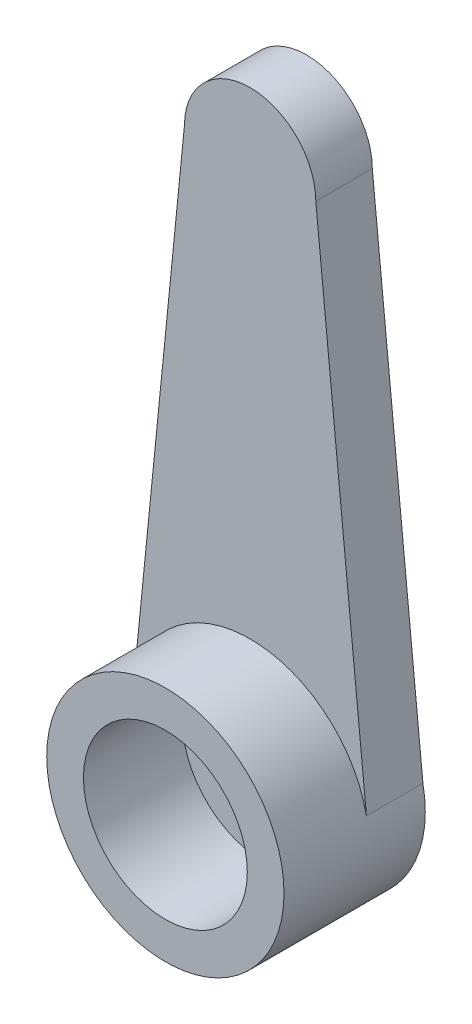
ISO-10303-21;
HEADER;
FILE_DESCRIPTION(('STEP AP214'),'2;1');
FILE_NAME('part.step','',(''),(''),'','','');
FILE_SCHEMA(('AUTOMOTIVE_DESIGN { 1 0 10303 214 1 1 1 1 }'));
ENDSEC;
DATA;
#1=APPLICATION_CONTEXT('core data for automotive mechanical design processes');
#2=APPLICATION_PROTOCOL_DEFINITION('international standard','automotive_design',2000,#1);
#3=PRODUCT_CONTEXT('',#1,'mechanical');
#4=PRODUCT('Part','Part','',(#3));
#5=PRODUCT_RELATED_PRODUCT_CATEGORY('part','',(#4));
#6=PRODUCT_DEFINITION_FORMATION('','',#4);
#7=PRODUCT_DEFINITION_CONTEXT('part definition',#1,'design');
#8=PRODUCT_DEFINITION('design','',#6,#7);
#9=PRODUCT_DEFINITION_SHAPE('','',#8);
#10=(LENGTH_UNIT() NAMED_UNIT(*) SI_UNIT(.MILLI.,.METRE.));
#11=(NAMED_UNIT(*) PLANE_ANGLE_UNIT() SI_UNIT($,.RADIAN.));
#12=(NAMED_UNIT(*) SI_UNIT($,.STERADIAN.) SOLID_ANGLE_UNIT());
#13=UNCERTAINTY_MEASURE_WITH_UNIT(LENGTH_MEASURE(1.E-05),#10,'distance_accuracy_value','');
#14=(GEOMETRIC_REPRESENTATION_CONTEXT(3) GLOBAL_UNCERTAINTY_ASSIGNED_CONTEXT((#13)) GLOBAL_UNIT_ASSIGNED_CONTEXT((#10,
#11,#12)) REPRESENTATION_CONTEXT('',''));
#15=CARTESIAN_POINT('',(0.,0.,0.));
#16=DIRECTION('',(0.,0.,1.));
#17=DIRECTION('',(1.,0.,0.));
#18=AXIS2_PLACEMENT_3D('',#15,#16,#17);
#19=CARTESIAN_POINT('',(4.15852541843245,0.41529881009645,2.));
#20=DIRECTION('',(0.995050300048582,0.0993725332937999,0.));
#21=DIRECTION('',(-0.0993725332937999,0.995050300048582,0.));
#22=AXIS2_PLACEMENT_3D('',#19,#20,#21);
#23=PLANE('',#22);
#24=DIRECTION('',(0.0993725332937999,-0.995050300048582,0.));
#25=VECTOR('',#24,1.);
#26=CARTESIAN_POINT('',(4.15852541843245,0.41529881009645,0.));
#27=LINE('',#26,#25);
#28=CARTESIAN_POINT('',(2.325,18.775,0.));
#29=VERTEX_POINT('',#28);
#30=CARTESIAN_POINT('',(4.11705083686489,0.830597620192895,0.));
#31=VERTEX_POINT('',#30);
#32=EDGE_CURVE('E80',#29,#31,#27,.T.);
#33=ORIENTED_EDGE('',*,*,#32,.F.);
#34=DIRECTION('',(0.,0.,-1.));
#35=VECTOR('',#34,1.);
#36=CARTESIAN_POINT('',(2.325,18.775,2.));
#37=LINE('',#36,#35);
#38=CARTESIAN_POINT('',(2.325,18.775,2.));
#39=VERTEX_POINT('',#38);
#40=EDGE_CURVE('E108',#39,#29,#37,.T.);
#41=ORIENTED_EDGE('',*,*,#40,.F.);
#42=DIRECTION('',(0.0993725332937999,-0.995050300048582,0.));
#43=VECTOR('',#42,1.);
#44=CARTESIAN_POINT('',(4.15852541843245,0.41529881009645,2.));
#45=LINE('',#44,#43);
#46=CARTESIAN_POINT('',(4.11705083686489,0.830597620192895,2.));
#47=VERTEX_POINT('',#46);
#48=EDGE_CURVE('E102',#39,#47,#45,.T.);
#49=ORIENTED_EDGE('',*,*,#48,.T.);
#50=DIRECTION('',(0.,0.,-1.));
#51=VECTOR('',#50,1.);
#52=CARTESIAN_POINT('',(4.11705083686489,0.830597620192895,2.));
#53=LINE('',#52,#51);
#54=EDGE_CURVE('E44',#47,#31,#53,.T.);
#55=ORIENTED_EDGE('',*,*,#54,.T.);
#56=EDGE_LOOP('',(#33,#41,#49,#55));
#57=FACE_BOUND('',#56,.T.);
#58=ADVANCED_FACE('F36',(#57),#23,.T.);
#59=CARTESIAN_POINT('',(0.,18.775,2.));
#60=DIRECTION('',(0.,0.,-1.));
#61=DIRECTION('',(-1.,0.,0.));
#62=AXIS2_PLACEMENT_3D('',#59,#60,#61);
#63=CYLINDRICAL_SURFACE('',#62,2.325);
#64=CARTESIAN_POINT('',(0.,18.775,0.));
#65=DIRECTION('',(0.,0.,1.));
#66=DIRECTION('',(1.,0.,0.));
#67=AXIS2_PLACEMENT_3D('',#64,#65,#66);
#68=CIRCLE('',#67,2.325);
#69=CARTESIAN_POINT('',(-2.325,18.775,0.));
#70=VERTEX_POINT('',#69);
#71=EDGE_CURVE('E65',#29,#70,#68,.T.);
#72=ORIENTED_EDGE('',*,*,#71,.T.);
#73=DIRECTION('',(0.,0.,-1.));
#74=VECTOR('',#73,1.);
#75=CARTESIAN_POINT('',(-2.325,18.775,2.));
#76=LINE('',#75,#74);
#77=CARTESIAN_POINT('',(-2.325,18.775,2.));
#78=VERTEX_POINT('',#77);
#79=EDGE_CURVE('E97',#78,#70,#76,.T.);
#80=ORIENTED_EDGE('',*,*,#79,.F.);
#81=CARTESIAN_POINT('',(0.,18.775,2.));
#82=DIRECTION('',(0.,0.,1.));
#83=DIRECTION('',(1.,0.,0.));
#84=AXIS2_PLACEMENT_3D('',#81,#82,#83);
#85=CIRCLE('',#84,2.325);
#86=EDGE_CURVE('E52',#39,#78,#85,.T.);
#87=ORIENTED_EDGE('',*,*,#86,.F.);
#88=ORIENTED_EDGE('',*,*,#40,.T.);
#89=EDGE_LOOP('',(#72,#80,#87,#88));
#90=FACE_BOUND('',#89,.T.);
#91=ADVANCED_FACE('F144',(#90),#63,.T.);
#92=CARTESIAN_POINT('',(-4.15852541843245,0.41529881009645,2.));
#93=DIRECTION('',(0.995050300048582,-0.0993725332937999,0.));
#94=DIRECTION('',(0.0993725332937999,0.995050300048582,0.));
#95=AXIS2_PLACEMENT_3D('',#92,#93,#94);
#96=PLANE('',#95);
#97=DIRECTION('',(-0.0993725332937999,-0.995050300048582,0.));
#98=VECTOR('',#97,1.);
#99=CARTESIAN_POINT('',(-4.15852541843245,0.41529881009645,0.));
#100=LINE('',#99,#98);
#101=CARTESIAN_POINT('',(-4.11705083686489,0.830597620192895,0.));
#102=VERTEX_POINT('',#101);
#103=EDGE_CURVE('E77',#70,#102,#100,.T.);
#104=ORIENTED_EDGE('',*,*,#103,.T.);
#105=DIRECTION('',(0.,0.,-1.));
#106=VECTOR('',#105,1.);
#107=CARTESIAN_POINT('',(-4.11705083686489,0.830597620192895,2.));
#108=LINE('',#107,#106);
#109=CARTESIAN_POINT('',(-4.11705083686489,0.830597620192895,2.));
#110=VERTEX_POINT('',#109);
#111=EDGE_CURVE('E89',#110,#102,#108,.T.);
#112=ORIENTED_EDGE('',*,*,#111,.F.);
#113=DIRECTION('',(-0.0993725332937999,-0.995050300048582,0.));
#114=VECTOR('',#113,1.);
#115=CARTESIAN_POINT('',(-4.15852541843245,0.41529881009645,2.));
#116=LINE('',#115,#114);
#117=EDGE_CURVE('E98',#78,#110,#116,.T.);
#118=ORIENTED_EDGE('',*,*,#117,.F.);
#119=ORIENTED_EDGE('',*,*,#79,.T.);
#120=EDGE_LOOP('',(#104,#112,#118,#119));
#121=FACE_BOUND('',#120,.T.);
#122=ADVANCED_FACE('F100',(#121),#96,.F.);
#123=CARTESIAN_POINT('',(0.,0.,2.));
#124=DIRECTION('',(0.,0.,1.));
#125=DIRECTION('',(1.,0.,0.));
#126=AXIS2_PLACEMENT_3D('',#123,#124,#125);
#127=PLANE('',#126);
#128=CARTESIAN_POINT('',(0.,0.,2.));
#129=DIRECTION('',(0.,0.,1.));
#130=DIRECTION('',(1.,0.,0.));
#131=AXIS2_PLACEMENT_3D('',#128,#129,#130);
#132=CIRCLE('',#131,4.2);
#133=EDGE_CURVE('E94',#47,#110,#132,.T.);
#134=ORIENTED_EDGE('',*,*,#133,.F.);
#135=ORIENTED_EDGE('',*,*,#48,.F.);
#136=ORIENTED_EDGE('',*,*,#86,.T.);
#137=ORIENTED_EDGE('',*,*,#117,.T.);
#138=EDGE_LOOP('',(#134,#135,#136,#137));
#139=FACE_BOUND('',#138,.T.);
#140=ADVANCED_FACE('F112',(#139),#127,.T.);
#141=CARTESIAN_POINT('',(0.,0.,0.));
#142=DIRECTION('',(0.,0.,1.));
#143=DIRECTION('',(1.,0.,0.));
#144=AXIS2_PLACEMENT_3D('',#141,#142,#143);
#145=PLANE('',#144);
#146=ORIENTED_EDGE('',*,*,#32,.T.);
#147=CARTESIAN_POINT('',(0.,0.,0.));
#148=DIRECTION('',(0.,0.,1.));
#149=DIRECTION('',(1.,0.,0.));
#150=AXIS2_PLACEMENT_3D('',#147,#148,#149);
#151=CIRCLE('',#150,4.2);
#152=EDGE_CURVE('E72',#102,#31,#151,.T.);
#153=ORIENTED_EDGE('',*,*,#152,.F.);
#154=ORIENTED_EDGE('',*,*,#103,.F.);
#155=ORIENTED_EDGE('',*,*,#71,.F.);
#156=EDGE_LOOP('',(#146,#153,#154,#155));
#157=FACE_BOUND('',#156,.T.);
#158=CARTESIAN_POINT('',(0.,0.,0.));
#159=DIRECTION('',(0.,0.,1.));
#160=DIRECTION('',(1.,0.,0.));
#161=AXIS2_PLACEMENT_3D('',#158,#159,#160);
#162=CIRCLE('',#161,1.5);
#163=CARTESIAN_POINT('',(1.5,0.,0.));
#164=VERTEX_POINT('',#163);
#165=EDGE_CURVE('E125',#164,#164,#162,.T.);
#166=ORIENTED_EDGE('',*,*,#165,.T.);
#167=EDGE_LOOP('',(#166));
#168=FACE_BOUND('',#167,.T.);
#169=ADVANCED_FACE('F74',(#157,#168),#145,.F.);
#170=CARTESIAN_POINT('',(0.,0.,5.));
#171=DIRECTION('',(0.,0.,-1.));
#172=DIRECTION('',(-1.,0.,0.));
#173=AXIS2_PLACEMENT_3D('',#170,#171,#172);
#174=CYLINDRICAL_SURFACE('',#173,4.2);
#175=ORIENTED_EDGE('',*,*,#54,.F.);
#176=ORIENTED_EDGE('',*,*,#133,.T.);
#177=ORIENTED_EDGE('',*,*,#111,.T.);
#178=ORIENTED_EDGE('',*,*,#152,.T.);
#179=EDGE_LOOP('',(#175,#176,#177,#178));
#180=FACE_BOUND('',#179,.T.);
#181=CARTESIAN_POINT('',(0.,0.,5.));
#182=DIRECTION('',(0.,0.,1.));
#183=DIRECTION('',(1.,0.,0.));
#184=AXIS2_PLACEMENT_3D('',#181,#182,#183);
#185=CIRCLE('',#184,4.2);
#186=CARTESIAN_POINT('',(4.2,0.,5.));
#187=VERTEX_POINT('',#186);
#188=EDGE_CURVE('E84',#187,#187,#185,.T.);
#189=ORIENTED_EDGE('',*,*,#188,.F.);
#190=EDGE_LOOP('',(#189));
#191=FACE_BOUND('',#190,.T.);
#192=ADVANCED_FACE('F90',(#180,#191),#174,.T.);
#193=CARTESIAN_POINT('',(0.,0.,5.));
#194=DIRECTION('',(0.,0.,-1.));
#195=DIRECTION('',(-1.,0.,0.));
#196=AXIS2_PLACEMENT_3D('',#193,#194,#195);
#197=CYLINDRICAL_SURFACE('',#196,2.9);
#198=CARTESIAN_POINT('',(0.,0.,1.5));
#199=DIRECTION('',(0.,0.,1.));
#200=DIRECTION('',(1.,0.,0.));
#201=AXIS2_PLACEMENT_3D('',#198,#199,#200);
#202=CIRCLE('',#201,2.9);
#203=CARTESIAN_POINT('',(2.9,0.,1.5));
#204=VERTEX_POINT('',#203);
#205=EDGE_CURVE('E11',#204,#204,#202,.T.);
#206=ORIENTED_EDGE('',*,*,#205,.F.);
#207=EDGE_LOOP('',(#206));
#208=FACE_BOUND('',#207,.T.);
#209=CARTESIAN_POINT('',(0.,0.,5.));
#210=DIRECTION('',(0.,0.,1.));
#211=DIRECTION('',(1.,0.,0.));
#212=AXIS2_PLACEMENT_3D('',#209,#210,#211);
#213=CIRCLE('',#212,2.9);
#214=CARTESIAN_POINT('',(2.9,0.,5.));
#215=VERTEX_POINT('',#214);
#216=EDGE_CURVE('E117',#215,#215,#213,.T.);
#217=ORIENTED_EDGE('',*,*,#216,.T.);
#218=EDGE_LOOP('',(#217));
#219=FACE_BOUND('',#218,.T.);
#220=ADVANCED_FACE('F159',(#208,#219),#197,.F.);
#221=CARTESIAN_POINT('',(0.,0.,5.));
#222=DIRECTION('',(0.,0.,1.));
#223=DIRECTION('',(1.,0.,0.));
#224=AXIS2_PLACEMENT_3D('',#221,#222,#223);
#225=PLANE('',#224);
#226=ORIENTED_EDGE('',*,*,#188,.T.);
#227=EDGE_LOOP('',(#226));
#228=FACE_BOUND('',#227,.T.);
#229=ORIENTED_EDGE('',*,*,#216,.F.);
#230=EDGE_LOOP('',(#229));
#231=FACE_BOUND('',#230,.T.);
#232=ADVANCED_FACE('F141',(#228,#231),#225,.T.);
#233=CARTESIAN_POINT('',(0.,0.,1.5));
#234=DIRECTION('',(0.,0.,-1.));
#235=DIRECTION('',(-1.,0.,0.));
#236=AXIS2_PLACEMENT_3D('',#233,#234,#235);
#237=CYLINDRICAL_SURFACE('',#236,1.5);
#238=CARTESIAN_POINT('',(0.,0.,1.5));
#239=DIRECTION('',(0.,0.,1.));
#240=DIRECTION('',(1.,0.,0.));
#241=AXIS2_PLACEMENT_3D('',#238,#239,#240);
#242=CIRCLE('',#241,1.5);
#243=CARTESIAN_POINT('',(1.5,0.,1.5));
#244=VERTEX_POINT('',#243);
#245=EDGE_CURVE('E85',#244,#244,#242,.T.);
#246=ORIENTED_EDGE('',*,*,#245,.T.);
#247=EDGE_LOOP('',(#246));
#248=FACE_BOUND('',#247,.T.);
#249=ORIENTED_EDGE('',*,*,#165,.F.);
#250=EDGE_LOOP('',(#249));
#251=FACE_BOUND('',#250,.T.);
#252=ADVANCED_FACE('F131',(#248,#251),#237,.F.);
#253=CARTESIAN_POINT('',(0.,0.,1.5));
#254=DIRECTION('',(0.,0.,1.));
#255=DIRECTION('',(1.,0.,0.));
#256=AXIS2_PLACEMENT_3D('',#253,#254,#255);
#257=PLANE('',#256);
#258=ORIENTED_EDGE('',*,*,#205,.T.);
#259=EDGE_LOOP('',(#258));
#260=FACE_BOUND('',#259,.T.);
#261=ORIENTED_EDGE('',*,*,#245,.F.);
#262=EDGE_LOOP('',(#261));
#263=FACE_BOUND('',#262,.T.);
#264=ADVANCED_FACE('F134',(#260,#263),#257,.T.);
#265=CLOSED_SHELL('',(#58,#91,#122,#140,#169,#192,#220,#232,#252,#264));
#266=MANIFOLD_SOLID_BREP('B2',#265);
#267=ADVANCED_BREP_SHAPE_REPRESENTATION('',(#18,#266),#14);
#268=SHAPE_DEFINITION_REPRESENTATION(#9,#267);
ENDSEC;
END-ISO-10303-21;
